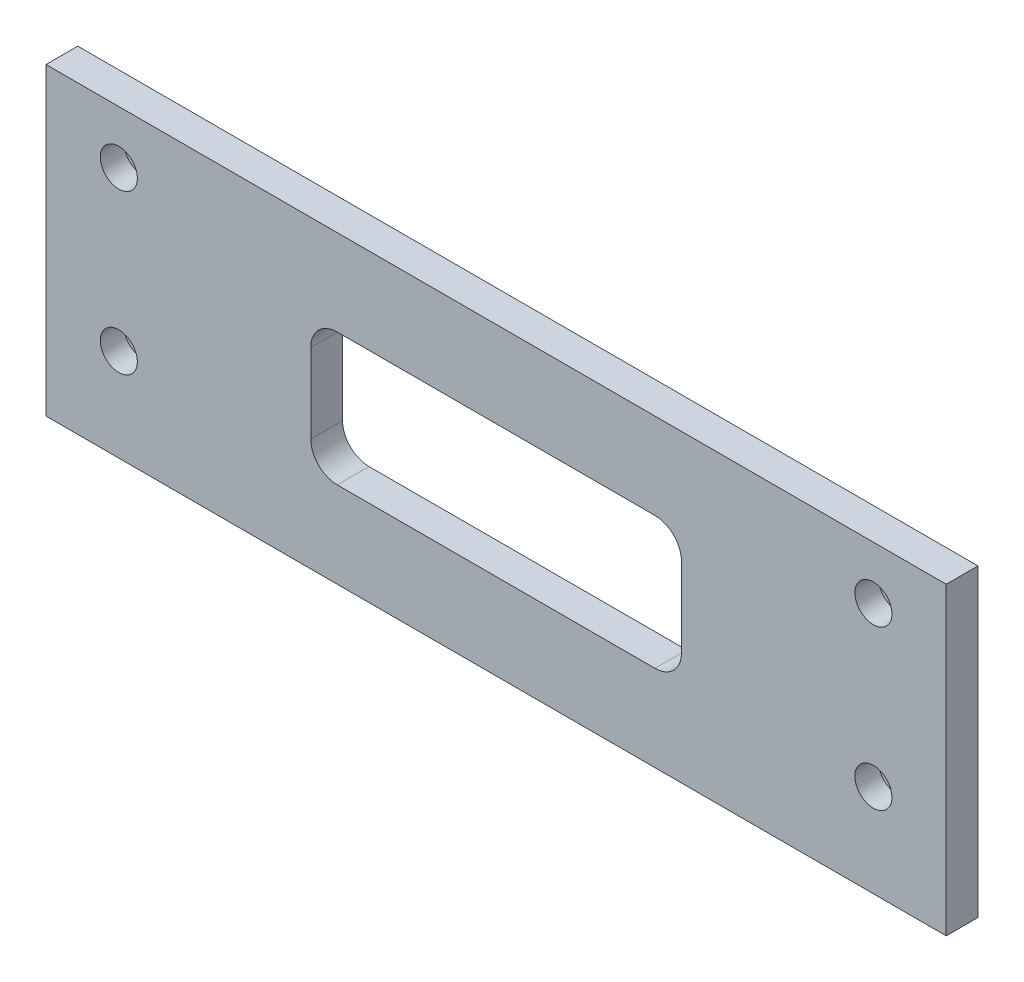
ISO-10303-21;
HEADER;
FILE_DESCRIPTION(('STEP AP214'),'2;1');
FILE_NAME('part.step','',(''),(''),'','','');
FILE_SCHEMA(('AUTOMOTIVE_DESIGN { 1 0 10303 214 1 1 1 1 }'));
ENDSEC;
DATA;
#1=APPLICATION_CONTEXT('core data for automotive mechanical design processes');
#2=APPLICATION_PROTOCOL_DEFINITION('international standard','automotive_design',2000,#1);
#3=PRODUCT_CONTEXT('',#1,'mechanical');
#4=PRODUCT('Part','Part','',(#3));
#5=PRODUCT_RELATED_PRODUCT_CATEGORY('part','',(#4));
#6=PRODUCT_DEFINITION_FORMATION('','',#4);
#7=PRODUCT_DEFINITION_CONTEXT('part definition',#1,'design');
#8=PRODUCT_DEFINITION('design','',#6,#7);
#9=PRODUCT_DEFINITION_SHAPE('','',#8);
#10=(LENGTH_UNIT() NAMED_UNIT(*) SI_UNIT(.MILLI.,.METRE.));
#11=(NAMED_UNIT(*) PLANE_ANGLE_UNIT() SI_UNIT($,.RADIAN.));
#12=(NAMED_UNIT(*) SI_UNIT($,.STERADIAN.) SOLID_ANGLE_UNIT());
#13=UNCERTAINTY_MEASURE_WITH_UNIT(LENGTH_MEASURE(1.E-05),#10,'distance_accuracy_value','');
#14=(GEOMETRIC_REPRESENTATION_CONTEXT(3) GLOBAL_UNCERTAINTY_ASSIGNED_CONTEXT((#13)) GLOBAL_UNIT_ASSIGNED_CONTEXT((#10,
#11,#12)) REPRESENTATION_CONTEXT('',''));
#15=CARTESIAN_POINT('',(0.,0.,0.));
#16=DIRECTION('',(0.,0.,1.));
#17=DIRECTION('',(1.,0.,0.));
#18=AXIS2_PLACEMENT_3D('',#15,#16,#17);
#19=CARTESIAN_POINT('',(170.,-57.5,12.));
#20=DIRECTION('',(-1.,0.,0.));
#21=DIRECTION('',(0.,0.,1.));
#22=AXIS2_PLACEMENT_3D('',#19,#20,#21);
#23=PLANE('',#22);
#24=DIRECTION('',(0.,1.,0.));
#25=VECTOR('',#24,1.);
#26=CARTESIAN_POINT('',(170.,-57.5,0.));
#27=LINE('',#26,#25);
#28=CARTESIAN_POINT('',(170.,-57.5,0.));
#29=VERTEX_POINT('',#28);
#30=CARTESIAN_POINT('',(170.,57.5,0.));
#31=VERTEX_POINT('',#30);
#32=EDGE_CURVE('E252',#29,#31,#27,.T.);
#33=ORIENTED_EDGE('',*,*,#32,.T.);
#34=DIRECTION('',(0.,0.,-1.));
#35=VECTOR('',#34,1.);
#36=CARTESIAN_POINT('',(170.,57.5,12.));
#37=LINE('',#36,#35);
#38=CARTESIAN_POINT('',(170.,57.5,12.));
#39=VERTEX_POINT('',#38);
#40=EDGE_CURVE('E13',#39,#31,#37,.T.);
#41=ORIENTED_EDGE('',*,*,#40,.F.);
#42=DIRECTION('',(0.,1.,0.));
#43=VECTOR('',#42,1.);
#44=CARTESIAN_POINT('',(170.,-57.5,12.));
#45=LINE('',#44,#43);
#46=CARTESIAN_POINT('',(170.,-57.5,12.));
#47=VERTEX_POINT('',#46);
#48=EDGE_CURVE('E253',#47,#39,#45,.T.);
#49=ORIENTED_EDGE('',*,*,#48,.F.);
#50=DIRECTION('',(0.,0.,-1.));
#51=VECTOR('',#50,1.);
#52=CARTESIAN_POINT('',(170.,-57.5,12.));
#53=LINE('',#52,#51);
#54=EDGE_CURVE('E263',#47,#29,#53,.T.);
#55=ORIENTED_EDGE('',*,*,#54,.T.);
#56=EDGE_LOOP('',(#33,#41,#49,#55));
#57=FACE_BOUND('',#56,.T.);
#58=ADVANCED_FACE('F48',(#57),#23,.F.);
#59=CARTESIAN_POINT('',(-170.,57.5,12.));
#60=DIRECTION('',(0.,-1.,0.));
#61=DIRECTION('',(0.,0.,-1.));
#62=AXIS2_PLACEMENT_3D('',#59,#60,#61);
#63=PLANE('',#62);
#64=DIRECTION('',(-1.,0.,0.));
#65=VECTOR('',#64,1.);
#66=CARTESIAN_POINT('',(-170.,57.5,0.));
#67=LINE('',#66,#65);
#68=CARTESIAN_POINT('',(-170.,57.5,0.));
#69=VERTEX_POINT('',#68);
#70=EDGE_CURVE('E266',#31,#69,#67,.T.);
#71=ORIENTED_EDGE('',*,*,#70,.T.);
#72=DIRECTION('',(0.,0.,-1.));
#73=VECTOR('',#72,1.);
#74=CARTESIAN_POINT('',(-170.,57.5,12.));
#75=LINE('',#74,#73);
#76=CARTESIAN_POINT('',(-170.,57.5,12.));
#77=VERTEX_POINT('',#76);
#78=EDGE_CURVE('E55',#77,#69,#75,.T.);
#79=ORIENTED_EDGE('',*,*,#78,.F.);
#80=DIRECTION('',(-1.,0.,0.));
#81=VECTOR('',#80,1.);
#82=CARTESIAN_POINT('',(-170.,57.5,12.));
#83=LINE('',#82,#81);
#84=EDGE_CURVE('E256',#39,#77,#83,.T.);
#85=ORIENTED_EDGE('',*,*,#84,.F.);
#86=ORIENTED_EDGE('',*,*,#40,.T.);
#87=EDGE_LOOP('',(#71,#79,#85,#86));
#88=FACE_BOUND('',#87,.T.);
#89=ADVANCED_FACE('F295',(#88),#63,.F.);
#90=CARTESIAN_POINT('',(-170.,-57.5,12.));
#91=DIRECTION('',(1.,0.,0.));
#92=DIRECTION('',(0.,0.,-1.));
#93=AXIS2_PLACEMENT_3D('',#90,#91,#92);
#94=PLANE('',#93);
#95=DIRECTION('',(0.,-1.,0.));
#96=VECTOR('',#95,1.);
#97=CARTESIAN_POINT('',(-170.,-57.5,0.));
#98=LINE('',#97,#96);
#99=CARTESIAN_POINT('',(-170.,-57.5,0.));
#100=VERTEX_POINT('',#99);
#101=EDGE_CURVE('E268',#69,#100,#98,.T.);
#102=ORIENTED_EDGE('',*,*,#101,.T.);
#103=DIRECTION('',(0.,0.,-1.));
#104=VECTOR('',#103,1.);
#105=CARTESIAN_POINT('',(-170.,-57.5,12.));
#106=LINE('',#105,#104);
#107=CARTESIAN_POINT('',(-170.,-57.5,12.));
#108=VERTEX_POINT('',#107);
#109=EDGE_CURVE('E273',#108,#100,#106,.T.);
#110=ORIENTED_EDGE('',*,*,#109,.F.);
#111=DIRECTION('',(0.,-1.,0.));
#112=VECTOR('',#111,1.);
#113=CARTESIAN_POINT('',(-170.,-57.5,12.));
#114=LINE('',#113,#112);
#115=EDGE_CURVE('E259',#77,#108,#114,.T.);
#116=ORIENTED_EDGE('',*,*,#115,.F.);
#117=ORIENTED_EDGE('',*,*,#78,.T.);
#118=EDGE_LOOP('',(#102,#110,#116,#117));
#119=FACE_BOUND('',#118,.T.);
#120=ADVANCED_FACE('F280',(#119),#94,.F.);
#121=CARTESIAN_POINT('',(-170.,-57.5,12.));
#122=DIRECTION('',(0.,1.,0.));
#123=DIRECTION('',(0.,0.,1.));
#124=AXIS2_PLACEMENT_3D('',#121,#122,#123);
#125=PLANE('',#124);
#126=DIRECTION('',(1.,0.,0.));
#127=VECTOR('',#126,1.);
#128=CARTESIAN_POINT('',(-170.,-57.5,0.));
#129=LINE('',#128,#127);
#130=EDGE_CURVE('E257',#100,#29,#129,.T.);
#131=ORIENTED_EDGE('',*,*,#130,.T.);
#132=ORIENTED_EDGE('',*,*,#54,.F.);
#133=DIRECTION('',(1.,0.,0.));
#134=VECTOR('',#133,1.);
#135=CARTESIAN_POINT('',(-170.,-57.5,12.));
#136=LINE('',#135,#134);
#137=EDGE_CURVE('E261',#108,#47,#136,.T.);
#138=ORIENTED_EDGE('',*,*,#137,.F.);
#139=ORIENTED_EDGE('',*,*,#109,.T.);
#140=EDGE_LOOP('',(#131,#132,#138,#139));
#141=FACE_BOUND('',#140,.T.);
#142=ADVANCED_FACE('F288',(#141),#125,.F.);
#143=CARTESIAN_POINT('',(0.,0.,12.));
#144=DIRECTION('',(0.,0.,-1.));
#145=DIRECTION('',(-1.,0.,0.));
#146=AXIS2_PLACEMENT_3D('',#143,#144,#145);
#147=PLANE('',#146);
#148=DIRECTION('',(0.,1.,0.));
#149=VECTOR('',#148,1.);
#150=CARTESIAN_POINT('',(70.,14.9999999999999,12.));
#151=LINE('',#150,#149);
#152=CARTESIAN_POINT('',(70.,-14.9999999999999,12.));
#153=VERTEX_POINT('',#152);
#154=CARTESIAN_POINT('',(70.,14.9999999999999,12.));
#155=VERTEX_POINT('',#154);
#156=EDGE_CURVE('E175',#153,#155,#151,.T.);
#157=ORIENTED_EDGE('',*,*,#156,.F.);
#158=CARTESIAN_POINT('',(60.,-15.,12.));
#159=DIRECTION('',(0.,0.,1.));
#160=DIRECTION('',(1.,0.,0.));
#161=AXIS2_PLACEMENT_3D('',#158,#159,#160);
#162=CIRCLE('',#161,10.);
#163=CARTESIAN_POINT('',(60.,-25.,12.));
#164=VERTEX_POINT('',#163);
#165=EDGE_CURVE('E62',#164,#153,#162,.T.);
#166=ORIENTED_EDGE('',*,*,#165,.F.);
#167=DIRECTION('',(1.,0.,0.));
#168=VECTOR('',#167,1.);
#169=CARTESIAN_POINT('',(-59.9999999999999,-25.,12.));
#170=LINE('',#169,#168);
#171=CARTESIAN_POINT('',(-59.9999999999999,-25.,12.));
#172=VERTEX_POINT('',#171);
#173=EDGE_CURVE('E155',#172,#164,#170,.T.);
#174=ORIENTED_EDGE('',*,*,#173,.F.);
#175=CARTESIAN_POINT('',(-60.,-15.,12.));
#176=DIRECTION('',(0.,0.,1.));
#177=DIRECTION('',(1.,0.,0.));
#178=AXIS2_PLACEMENT_3D('',#175,#176,#177);
#179=CIRCLE('',#178,10.);
#180=CARTESIAN_POINT('',(-70.,-14.9999999999999,12.));
#181=VERTEX_POINT('',#180);
#182=EDGE_CURVE('E158',#181,#172,#179,.T.);
#183=ORIENTED_EDGE('',*,*,#182,.F.);
#184=DIRECTION('',(0.,-1.,0.));
#185=VECTOR('',#184,1.);
#186=CARTESIAN_POINT('',(-70.,14.9999999999999,12.));
#187=LINE('',#186,#185);
#188=CARTESIAN_POINT('',(-70.,14.9999999999999,12.));
#189=VERTEX_POINT('',#188);
#190=EDGE_CURVE('E186',#189,#181,#187,.T.);
#191=ORIENTED_EDGE('',*,*,#190,.F.);
#192=CARTESIAN_POINT('',(-60.,15.,12.));
#193=DIRECTION('',(0.,0.,1.));
#194=DIRECTION('',(1.,0.,0.));
#195=AXIS2_PLACEMENT_3D('',#192,#193,#194);
#196=CIRCLE('',#195,10.);
#197=CARTESIAN_POINT('',(-59.9999999999999,25.,12.));
#198=VERTEX_POINT('',#197);
#199=EDGE_CURVE('E183',#198,#189,#196,.T.);
#200=ORIENTED_EDGE('',*,*,#199,.F.);
#201=DIRECTION('',(-1.,0.,0.));
#202=VECTOR('',#201,1.);
#203=CARTESIAN_POINT('',(-59.9999999999999,25.,12.));
#204=LINE('',#203,#202);
#205=CARTESIAN_POINT('',(60.,25.,12.));
#206=VERTEX_POINT('',#205);
#207=EDGE_CURVE('E180',#206,#198,#204,.T.);
#208=ORIENTED_EDGE('',*,*,#207,.F.);
#209=CARTESIAN_POINT('',(60.,15.,12.));
#210=DIRECTION('',(0.,0.,1.));
#211=DIRECTION('',(-1.,0.,0.));
#212=AXIS2_PLACEMENT_3D('',#209,#210,#211);
#213=CIRCLE('',#212,10.);
#214=EDGE_CURVE('E177',#155,#206,#213,.T.);
#215=ORIENTED_EDGE('',*,*,#214,.F.);
#216=EDGE_LOOP('',(#157,#166,#174,#183,#191,#200,#208,#215));
#217=FACE_BOUND('',#216,.T.);
#218=CARTESIAN_POINT('',(-142.5,37.5,12.));
#219=DIRECTION('',(0.,0.,1.));
#220=DIRECTION('',(1.,0.,0.));
#221=AXIS2_PLACEMENT_3D('',#218,#219,#220);
#222=CIRCLE('',#221,7.00000000000001);
#223=CARTESIAN_POINT('',(-135.5,37.5,12.));
#224=VERTEX_POINT('',#223);
#225=EDGE_CURVE('E193',#224,#224,#222,.T.);
#226=ORIENTED_EDGE('',*,*,#225,.F.);
#227=EDGE_LOOP('',(#226));
#228=FACE_BOUND('',#227,.T.);
#229=CARTESIAN_POINT('',(142.5,37.5,12.));
#230=DIRECTION('',(0.,0.,1.));
#231=DIRECTION('',(1.,0.,0.));
#232=AXIS2_PLACEMENT_3D('',#229,#230,#231);
#233=CIRCLE('',#232,7.00000000000001);
#234=CARTESIAN_POINT('',(149.5,37.5,12.));
#235=VERTEX_POINT('',#234);
#236=EDGE_CURVE('E216',#235,#235,#233,.T.);
#237=ORIENTED_EDGE('',*,*,#236,.F.);
#238=EDGE_LOOP('',(#237));
#239=FACE_BOUND('',#238,.T.);
#240=CARTESIAN_POINT('',(142.5,-22.5,12.));
#241=DIRECTION('',(0.,0.,1.));
#242=DIRECTION('',(1.,0.,0.));
#243=AXIS2_PLACEMENT_3D('',#240,#241,#242);
#244=CIRCLE('',#243,7.00000000000001);
#245=CARTESIAN_POINT('',(149.5,-22.5,12.));
#246=VERTEX_POINT('',#245);
#247=EDGE_CURVE('E228',#246,#246,#244,.T.);
#248=ORIENTED_EDGE('',*,*,#247,.F.);
#249=EDGE_LOOP('',(#248));
#250=FACE_BOUND('',#249,.T.);
#251=CARTESIAN_POINT('',(-142.5,-22.5,12.));
#252=DIRECTION('',(0.,0.,1.));
#253=DIRECTION('',(1.,0.,0.));
#254=AXIS2_PLACEMENT_3D('',#251,#252,#253);
#255=CIRCLE('',#254,7.00000000000001);
#256=CARTESIAN_POINT('',(-135.5,-22.5,12.));
#257=VERTEX_POINT('',#256);
#258=EDGE_CURVE('E240',#257,#257,#255,.T.);
#259=ORIENTED_EDGE('',*,*,#258,.F.);
#260=EDGE_LOOP('',(#259));
#261=FACE_BOUND('',#260,.T.);
#262=ORIENTED_EDGE('',*,*,#48,.T.);
#263=ORIENTED_EDGE('',*,*,#84,.T.);
#264=ORIENTED_EDGE('',*,*,#115,.T.);
#265=ORIENTED_EDGE('',*,*,#137,.T.);
#266=EDGE_LOOP('',(#262,#263,#264,#265));
#267=FACE_BOUND('',#266,.T.);
#268=ADVANCED_FACE('F294',(#217,#228,#239,#250,#261,#267),#147,.F.);
#269=CARTESIAN_POINT('',(0.,0.,0.));
#270=DIRECTION('',(0.,0.,-1.));
#271=DIRECTION('',(-1.,0.,0.));
#272=AXIS2_PLACEMENT_3D('',#269,#270,#271);
#273=PLANE('',#272);
#274=CARTESIAN_POINT('',(60.,-15.,0.));
#275=DIRECTION('',(0.,0.,1.));
#276=DIRECTION('',(1.,0.,0.));
#277=AXIS2_PLACEMENT_3D('',#274,#275,#276);
#278=CIRCLE('',#277,10.);
#279=CARTESIAN_POINT('',(60.,-25.,0.));
#280=VERTEX_POINT('',#279);
#281=CARTESIAN_POINT('',(70.,-14.9999999999999,0.));
#282=VERTEX_POINT('',#281);
#283=EDGE_CURVE('E138',#280,#282,#278,.T.);
#284=ORIENTED_EDGE('',*,*,#283,.T.);
#285=DIRECTION('',(0.,1.,0.));
#286=VECTOR('',#285,1.);
#287=CARTESIAN_POINT('',(70.,14.9999999999999,0.));
#288=LINE('',#287,#286);
#289=CARTESIAN_POINT('',(70.,14.9999999999999,0.));
#290=VERTEX_POINT('',#289);
#291=EDGE_CURVE('E147',#282,#290,#288,.T.);
#292=ORIENTED_EDGE('',*,*,#291,.T.);
#293=CARTESIAN_POINT('',(60.,15.,0.));
#294=DIRECTION('',(0.,0.,1.));
#295=DIRECTION('',(-1.,0.,0.));
#296=AXIS2_PLACEMENT_3D('',#293,#294,#295);
#297=CIRCLE('',#296,10.);
#298=CARTESIAN_POINT('',(60.,25.,0.));
#299=VERTEX_POINT('',#298);
#300=EDGE_CURVE('E70',#290,#299,#297,.T.);
#301=ORIENTED_EDGE('',*,*,#300,.T.);
#302=DIRECTION('',(-1.,0.,0.));
#303=VECTOR('',#302,1.);
#304=CARTESIAN_POINT('',(-59.9999999999999,25.,0.));
#305=LINE('',#304,#303);
#306=CARTESIAN_POINT('',(-59.9999999999999,25.,0.));
#307=VERTEX_POINT('',#306);
#308=EDGE_CURVE('E162',#299,#307,#305,.T.);
#309=ORIENTED_EDGE('',*,*,#308,.T.);
#310=CARTESIAN_POINT('',(-60.,15.,0.));
#311=DIRECTION('',(0.,0.,1.));
#312=DIRECTION('',(1.,0.,0.));
#313=AXIS2_PLACEMENT_3D('',#310,#311,#312);
#314=CIRCLE('',#313,10.);
#315=CARTESIAN_POINT('',(-70.,14.9999999999999,0.));
#316=VERTEX_POINT('',#315);
#317=EDGE_CURVE('E165',#307,#316,#314,.T.);
#318=ORIENTED_EDGE('',*,*,#317,.T.);
#319=DIRECTION('',(0.,-1.,0.));
#320=VECTOR('',#319,1.);
#321=CARTESIAN_POINT('',(-70.,14.9999999999999,0.));
#322=LINE('',#321,#320);
#323=CARTESIAN_POINT('',(-70.,-14.9999999999999,0.));
#324=VERTEX_POINT('',#323);
#325=EDGE_CURVE('E168',#316,#324,#322,.T.);
#326=ORIENTED_EDGE('',*,*,#325,.T.);
#327=CARTESIAN_POINT('',(-60.,-15.,0.));
#328=DIRECTION('',(0.,0.,1.));
#329=DIRECTION('',(1.,0.,0.));
#330=AXIS2_PLACEMENT_3D('',#327,#328,#329);
#331=CIRCLE('',#330,10.);
#332=CARTESIAN_POINT('',(-59.9999999999999,-25.,0.));
#333=VERTEX_POINT('',#332);
#334=EDGE_CURVE('E171',#324,#333,#331,.T.);
#335=ORIENTED_EDGE('',*,*,#334,.T.);
#336=DIRECTION('',(1.,0.,0.));
#337=VECTOR('',#336,1.);
#338=CARTESIAN_POINT('',(-59.9999999999999,-25.,0.));
#339=LINE('',#338,#337);
#340=EDGE_CURVE('E144',#333,#280,#339,.T.);
#341=ORIENTED_EDGE('',*,*,#340,.T.);
#342=EDGE_LOOP('',(#284,#292,#301,#309,#318,#326,#335,#341));
#343=FACE_BOUND('',#342,.T.);
#344=CARTESIAN_POINT('',(-142.5,37.5,0.));
#345=DIRECTION('',(0.,0.,1.));
#346=DIRECTION('',(1.,0.,0.));
#347=AXIS2_PLACEMENT_3D('',#344,#345,#346);
#348=CIRCLE('',#347,4.5);
#349=CARTESIAN_POINT('',(-138.,37.5,0.));
#350=VERTEX_POINT('',#349);
#351=EDGE_CURVE('E213',#350,#350,#348,.T.);
#352=ORIENTED_EDGE('',*,*,#351,.T.);
#353=EDGE_LOOP('',(#352));
#354=FACE_BOUND('',#353,.T.);
#355=CARTESIAN_POINT('',(142.5,37.5,0.));
#356=DIRECTION('',(0.,0.,1.));
#357=DIRECTION('',(1.,0.,0.));
#358=AXIS2_PLACEMENT_3D('',#355,#356,#357);
#359=CIRCLE('',#358,4.5);
#360=CARTESIAN_POINT('',(147.,37.5,0.));
#361=VERTEX_POINT('',#360);
#362=EDGE_CURVE('E225',#361,#361,#359,.T.);
#363=ORIENTED_EDGE('',*,*,#362,.T.);
#364=EDGE_LOOP('',(#363));
#365=FACE_BOUND('',#364,.T.);
#366=CARTESIAN_POINT('',(142.5,-22.5,0.));
#367=DIRECTION('',(0.,0.,1.));
#368=DIRECTION('',(1.,0.,0.));
#369=AXIS2_PLACEMENT_3D('',#366,#367,#368);
#370=CIRCLE('',#369,4.5);
#371=CARTESIAN_POINT('',(147.,-22.5,0.));
#372=VERTEX_POINT('',#371);
#373=EDGE_CURVE('E237',#372,#372,#370,.T.);
#374=ORIENTED_EDGE('',*,*,#373,.T.);
#375=EDGE_LOOP('',(#374));
#376=FACE_BOUND('',#375,.T.);
#377=CARTESIAN_POINT('',(-142.5,-22.5,0.));
#378=DIRECTION('',(0.,0.,1.));
#379=DIRECTION('',(1.,0.,0.));
#380=AXIS2_PLACEMENT_3D('',#377,#378,#379);
#381=CIRCLE('',#380,4.5);
#382=CARTESIAN_POINT('',(-138.,-22.5,0.));
#383=VERTEX_POINT('',#382);
#384=EDGE_CURVE('E249',#383,#383,#381,.T.);
#385=ORIENTED_EDGE('',*,*,#384,.T.);
#386=EDGE_LOOP('',(#385));
#387=FACE_BOUND('',#386,.T.);
#388=ORIENTED_EDGE('',*,*,#32,.F.);
#389=ORIENTED_EDGE('',*,*,#130,.F.);
#390=ORIENTED_EDGE('',*,*,#101,.F.);
#391=ORIENTED_EDGE('',*,*,#70,.F.);
#392=EDGE_LOOP('',(#388,#389,#390,#391));
#393=FACE_BOUND('',#392,.T.);
#394=ADVANCED_FACE('F151',(#343,#354,#365,#376,#387,#393),#273,.T.);
#395=CARTESIAN_POINT('',(-142.5,-22.5,12.));
#396=DIRECTION('',(0.,0.,1.));
#397=DIRECTION('',(1.,0.,0.));
#398=AXIS2_PLACEMENT_3D('',#395,#396,#397);
#399=CYLINDRICAL_SURFACE('',#398,4.5);
#400=ORIENTED_EDGE('',*,*,#384,.F.);
#401=EDGE_LOOP('',(#400));
#402=FACE_BOUND('',#401,.T.);
#403=CARTESIAN_POINT('',(-142.5,-22.5,3.));
#404=DIRECTION('',(0.,0.,1.));
#405=DIRECTION('',(1.,0.,0.));
#406=AXIS2_PLACEMENT_3D('',#403,#404,#405);
#407=CIRCLE('',#406,4.5);
#408=CARTESIAN_POINT('',(-138.,-22.5,3.));
#409=VERTEX_POINT('',#408);
#410=EDGE_CURVE('E246',#409,#409,#407,.T.);
#411=ORIENTED_EDGE('',*,*,#410,.T.);
#412=EDGE_LOOP('',(#411));
#413=FACE_BOUND('',#412,.T.);
#414=ADVANCED_FACE('F307',(#402,#413),#399,.F.);
#415=CARTESIAN_POINT('',(-138.,-22.5,3.));
#416=DIRECTION('',(0.,0.,-1.));
#417=DIRECTION('',(-1.,0.,0.));
#418=AXIS2_PLACEMENT_3D('',#415,#416,#417);
#419=PLANE('',#418);
#420=ORIENTED_EDGE('',*,*,#410,.F.);
#421=EDGE_LOOP('',(#420));
#422=FACE_BOUND('',#421,.T.);
#423=CARTESIAN_POINT('',(-142.5,-22.5,3.));
#424=DIRECTION('',(0.,0.,1.));
#425=DIRECTION('',(1.,0.,0.));
#426=AXIS2_PLACEMENT_3D('',#423,#424,#425);
#427=CIRCLE('',#426,7.00000000000001);
#428=CARTESIAN_POINT('',(-135.5,-22.5,3.));
#429=VERTEX_POINT('',#428);
#430=EDGE_CURVE('E243',#429,#429,#427,.T.);
#431=ORIENTED_EDGE('',*,*,#430,.T.);
#432=EDGE_LOOP('',(#431));
#433=FACE_BOUND('',#432,.T.);
#434=ADVANCED_FACE('F313',(#422,#433),#419,.F.);
#435=CARTESIAN_POINT('',(-142.5,-22.5,12.));
#436=DIRECTION('',(0.,0.,1.));
#437=DIRECTION('',(1.,0.,0.));
#438=AXIS2_PLACEMENT_3D('',#435,#436,#437);
#439=CYLINDRICAL_SURFACE('',#438,7.00000000000001);
#440=ORIENTED_EDGE('',*,*,#430,.F.);
#441=EDGE_LOOP('',(#440));
#442=FACE_BOUND('',#441,.T.);
#443=ORIENTED_EDGE('',*,*,#258,.T.);
#444=EDGE_LOOP('',(#443));
#445=FACE_BOUND('',#444,.T.);
#446=ADVANCED_FACE('F317',(#442,#445),#439,.F.);
#447=CARTESIAN_POINT('',(142.5,-22.5,12.));
#448=DIRECTION('',(0.,0.,1.));
#449=DIRECTION('',(1.,0.,0.));
#450=AXIS2_PLACEMENT_3D('',#447,#448,#449);
#451=CYLINDRICAL_SURFACE('',#450,4.5);
#452=ORIENTED_EDGE('',*,*,#373,.F.);
#453=EDGE_LOOP('',(#452));
#454=FACE_BOUND('',#453,.T.);
#455=CARTESIAN_POINT('',(142.5,-22.5,3.));
#456=DIRECTION('',(0.,0.,1.));
#457=DIRECTION('',(1.,0.,0.));
#458=AXIS2_PLACEMENT_3D('',#455,#456,#457);
#459=CIRCLE('',#458,4.5);
#460=CARTESIAN_POINT('',(147.,-22.5,3.));
#461=VERTEX_POINT('',#460);
#462=EDGE_CURVE('E234',#461,#461,#459,.T.);
#463=ORIENTED_EDGE('',*,*,#462,.T.);
#464=EDGE_LOOP('',(#463));
#465=FACE_BOUND('',#464,.T.);
#466=ADVANCED_FACE('F321',(#454,#465),#451,.F.);
#467=CARTESIAN_POINT('',(147.,-22.5,3.));
#468=DIRECTION('',(0.,0.,-1.));
#469=DIRECTION('',(-1.,0.,0.));
#470=AXIS2_PLACEMENT_3D('',#467,#468,#469);
#471=PLANE('',#470);
#472=ORIENTED_EDGE('',*,*,#462,.F.);
#473=EDGE_LOOP('',(#472));
#474=FACE_BOUND('',#473,.T.);
#475=CARTESIAN_POINT('',(142.5,-22.5,3.));
#476=DIRECTION('',(0.,0.,1.));
#477=DIRECTION('',(1.,0.,0.));
#478=AXIS2_PLACEMENT_3D('',#475,#476,#477);
#479=CIRCLE('',#478,7.00000000000001);
#480=CARTESIAN_POINT('',(149.5,-22.5,3.));
#481=VERTEX_POINT('',#480);
#482=EDGE_CURVE('E231',#481,#481,#479,.T.);
#483=ORIENTED_EDGE('',*,*,#482,.T.);
#484=EDGE_LOOP('',(#483));
#485=FACE_BOUND('',#484,.T.);
#486=ADVANCED_FACE('F325',(#474,#485),#471,.F.);
#487=CARTESIAN_POINT('',(142.5,-22.5,12.));
#488=DIRECTION('',(0.,0.,1.));
#489=DIRECTION('',(1.,0.,0.));
#490=AXIS2_PLACEMENT_3D('',#487,#488,#489);
#491=CYLINDRICAL_SURFACE('',#490,7.00000000000001);
#492=ORIENTED_EDGE('',*,*,#482,.F.);
#493=EDGE_LOOP('',(#492));
#494=FACE_BOUND('',#493,.T.);
#495=ORIENTED_EDGE('',*,*,#247,.T.);
#496=EDGE_LOOP('',(#495));
#497=FACE_BOUND('',#496,.T.);
#498=ADVANCED_FACE('F329',(#494,#497),#491,.F.);
#499=CARTESIAN_POINT('',(142.5,37.5,12.));
#500=DIRECTION('',(0.,0.,1.));
#501=DIRECTION('',(1.,0.,0.));
#502=AXIS2_PLACEMENT_3D('',#499,#500,#501);
#503=CYLINDRICAL_SURFACE('',#502,4.5);
#504=ORIENTED_EDGE('',*,*,#362,.F.);
#505=EDGE_LOOP('',(#504));
#506=FACE_BOUND('',#505,.T.);
#507=CARTESIAN_POINT('',(142.5,37.5,3.));
#508=DIRECTION('',(0.,0.,1.));
#509=DIRECTION('',(1.,0.,0.));
#510=AXIS2_PLACEMENT_3D('',#507,#508,#509);
#511=CIRCLE('',#510,4.5);
#512=CARTESIAN_POINT('',(147.,37.5,3.));
#513=VERTEX_POINT('',#512);
#514=EDGE_CURVE('E222',#513,#513,#511,.T.);
#515=ORIENTED_EDGE('',*,*,#514,.T.);
#516=EDGE_LOOP('',(#515));
#517=FACE_BOUND('',#516,.T.);
#518=ADVANCED_FACE('F333',(#506,#517),#503,.F.);
#519=CARTESIAN_POINT('',(147.,37.5,3.));
#520=DIRECTION('',(0.,0.,-1.));
#521=DIRECTION('',(-1.,0.,0.));
#522=AXIS2_PLACEMENT_3D('',#519,#520,#521);
#523=PLANE('',#522);
#524=ORIENTED_EDGE('',*,*,#514,.F.);
#525=EDGE_LOOP('',(#524));
#526=FACE_BOUND('',#525,.T.);
#527=CARTESIAN_POINT('',(142.5,37.5,3.));
#528=DIRECTION('',(0.,0.,1.));
#529=DIRECTION('',(1.,0.,0.));
#530=AXIS2_PLACEMENT_3D('',#527,#528,#529);
#531=CIRCLE('',#530,7.00000000000001);
#532=CARTESIAN_POINT('',(149.5,37.5,3.));
#533=VERTEX_POINT('',#532);
#534=EDGE_CURVE('E219',#533,#533,#531,.T.);
#535=ORIENTED_EDGE('',*,*,#534,.T.);
#536=EDGE_LOOP('',(#535));
#537=FACE_BOUND('',#536,.T.);
#538=ADVANCED_FACE('F337',(#526,#537),#523,.F.);
#539=CARTESIAN_POINT('',(142.5,37.5,12.));
#540=DIRECTION('',(0.,0.,1.));
#541=DIRECTION('',(1.,0.,0.));
#542=AXIS2_PLACEMENT_3D('',#539,#540,#541);
#543=CYLINDRICAL_SURFACE('',#542,7.00000000000001);
#544=ORIENTED_EDGE('',*,*,#534,.F.);
#545=EDGE_LOOP('',(#544));
#546=FACE_BOUND('',#545,.T.);
#547=ORIENTED_EDGE('',*,*,#236,.T.);
#548=EDGE_LOOP('',(#547));
#549=FACE_BOUND('',#548,.T.);
#550=ADVANCED_FACE('F341',(#546,#549),#543,.F.);
#551=CARTESIAN_POINT('',(-142.5,37.5,12.));
#552=DIRECTION('',(0.,0.,1.));
#553=DIRECTION('',(1.,0.,0.));
#554=AXIS2_PLACEMENT_3D('',#551,#552,#553);
#555=CYLINDRICAL_SURFACE('',#554,4.5);
#556=ORIENTED_EDGE('',*,*,#351,.F.);
#557=EDGE_LOOP('',(#556));
#558=FACE_BOUND('',#557,.T.);
#559=CARTESIAN_POINT('',(-142.5,37.5,3.));
#560=DIRECTION('',(0.,0.,1.));
#561=DIRECTION('',(1.,0.,0.));
#562=AXIS2_PLACEMENT_3D('',#559,#560,#561);
#563=CIRCLE('',#562,4.5);
#564=CARTESIAN_POINT('',(-138.,37.5,3.));
#565=VERTEX_POINT('',#564);
#566=EDGE_CURVE('E210',#565,#565,#563,.T.);
#567=ORIENTED_EDGE('',*,*,#566,.T.);
#568=EDGE_LOOP('',(#567));
#569=FACE_BOUND('',#568,.T.);
#570=ADVANCED_FACE('F345',(#558,#569),#555,.F.);
#571=CARTESIAN_POINT('',(-138.,37.5,3.));
#572=DIRECTION('',(0.,0.,-1.));
#573=DIRECTION('',(-1.,0.,0.));
#574=AXIS2_PLACEMENT_3D('',#571,#572,#573);
#575=PLANE('',#574);
#576=ORIENTED_EDGE('',*,*,#566,.F.);
#577=EDGE_LOOP('',(#576));
#578=FACE_BOUND('',#577,.T.);
#579=CARTESIAN_POINT('',(-142.5,37.5,3.));
#580=DIRECTION('',(0.,0.,1.));
#581=DIRECTION('',(1.,0.,0.));
#582=AXIS2_PLACEMENT_3D('',#579,#580,#581);
#583=CIRCLE('',#582,7.00000000000001);
#584=CARTESIAN_POINT('',(-135.5,37.5,3.));
#585=VERTEX_POINT('',#584);
#586=EDGE_CURVE('E207',#585,#585,#583,.T.);
#587=ORIENTED_EDGE('',*,*,#586,.T.);
#588=EDGE_LOOP('',(#587));
#589=FACE_BOUND('',#588,.T.);
#590=ADVANCED_FACE('F349',(#578,#589),#575,.F.);
#591=CARTESIAN_POINT('',(-142.5,37.5,12.));
#592=DIRECTION('',(0.,0.,1.));
#593=DIRECTION('',(1.,0.,0.));
#594=AXIS2_PLACEMENT_3D('',#591,#592,#593);
#595=CYLINDRICAL_SURFACE('',#594,7.00000000000001);
#596=ORIENTED_EDGE('',*,*,#586,.F.);
#597=EDGE_LOOP('',(#596));
#598=FACE_BOUND('',#597,.T.);
#599=ORIENTED_EDGE('',*,*,#225,.T.);
#600=EDGE_LOOP('',(#599));
#601=FACE_BOUND('',#600,.T.);
#602=ADVANCED_FACE('F353',(#598,#601),#595,.F.);
#603=CARTESIAN_POINT('',(60.,-15.,0.));
#604=DIRECTION('',(0.,0.,1.));
#605=DIRECTION('',(1.,0.,0.));
#606=AXIS2_PLACEMENT_3D('',#603,#604,#605);
#607=CYLINDRICAL_SURFACE('',#606,10.);
#608=ORIENTED_EDGE('',*,*,#165,.T.);
#609=DIRECTION('',(0.,0.,1.));
#610=VECTOR('',#609,1.);
#611=CARTESIAN_POINT('',(70.,-14.9999999999999,0.));
#612=LINE('',#611,#610);
#613=EDGE_CURVE('E134',#282,#153,#612,.T.);
#614=ORIENTED_EDGE('',*,*,#613,.F.);
#615=ORIENTED_EDGE('',*,*,#283,.F.);
#616=DIRECTION('',(0.,0.,1.));
#617=VECTOR('',#616,1.);
#618=CARTESIAN_POINT('',(60.,-25.,0.));
#619=LINE('',#618,#617);
#620=EDGE_CURVE('E191',#280,#164,#619,.T.);
#621=ORIENTED_EDGE('',*,*,#620,.T.);
#622=EDGE_LOOP('',(#608,#614,#615,#621));
#623=FACE_BOUND('',#622,.T.);
#624=ADVANCED_FACE('F136',(#623),#607,.F.);
#625=CARTESIAN_POINT('',(-59.9999999999999,-25.,0.));
#626=DIRECTION('',(0.,-1.,0.));
#627=DIRECTION('',(0.,0.,-1.));
#628=AXIS2_PLACEMENT_3D('',#625,#626,#627);
#629=PLANE('',#628);
#630=ORIENTED_EDGE('',*,*,#173,.T.);
#631=ORIENTED_EDGE('',*,*,#620,.F.);
#632=ORIENTED_EDGE('',*,*,#340,.F.);
#633=DIRECTION('',(0.,0.,1.));
#634=VECTOR('',#633,1.);
#635=CARTESIAN_POINT('',(-59.9999999999999,-25.,0.));
#636=LINE('',#635,#634);
#637=EDGE_CURVE('E194',#333,#172,#636,.T.);
#638=ORIENTED_EDGE('',*,*,#637,.T.);
#639=EDGE_LOOP('',(#630,#631,#632,#638));
#640=FACE_BOUND('',#639,.T.);
#641=ADVANCED_FACE('F360',(#640),#629,.F.);
#642=CARTESIAN_POINT('',(-60.,-15.,0.));
#643=DIRECTION('',(0.,0.,1.));
#644=DIRECTION('',(1.,0.,0.));
#645=AXIS2_PLACEMENT_3D('',#642,#643,#644);
#646=CYLINDRICAL_SURFACE('',#645,10.);
#647=ORIENTED_EDGE('',*,*,#182,.T.);
#648=ORIENTED_EDGE('',*,*,#637,.F.);
#649=ORIENTED_EDGE('',*,*,#334,.F.);
#650=DIRECTION('',(0.,0.,1.));
#651=VECTOR('',#650,1.);
#652=CARTESIAN_POINT('',(-70.,-14.9999999999999,0.));
#653=LINE('',#652,#651);
#654=EDGE_CURVE('E196',#324,#181,#653,.T.);
#655=ORIENTED_EDGE('',*,*,#654,.T.);
#656=EDGE_LOOP('',(#647,#648,#649,#655));
#657=FACE_BOUND('',#656,.T.);
#658=ADVANCED_FACE('F377',(#657),#646,.F.);
#659=CARTESIAN_POINT('',(-70.,14.9999999999999,0.));
#660=DIRECTION('',(-1.,0.,0.));
#661=DIRECTION('',(0.,0.,1.));
#662=AXIS2_PLACEMENT_3D('',#659,#660,#661);
#663=PLANE('',#662);
#664=ORIENTED_EDGE('',*,*,#190,.T.);
#665=ORIENTED_EDGE('',*,*,#654,.F.);
#666=ORIENTED_EDGE('',*,*,#325,.F.);
#667=DIRECTION('',(0.,0.,1.));
#668=VECTOR('',#667,1.);
#669=CARTESIAN_POINT('',(-70.,14.9999999999999,0.));
#670=LINE('',#669,#668);
#671=EDGE_CURVE('E198',#316,#189,#670,.T.);
#672=ORIENTED_EDGE('',*,*,#671,.T.);
#673=EDGE_LOOP('',(#664,#665,#666,#672));
#674=FACE_BOUND('',#673,.T.);
#675=ADVANCED_FACE('F373',(#674),#663,.F.);
#676=CARTESIAN_POINT('',(-60.,15.,0.));
#677=DIRECTION('',(0.,0.,1.));
#678=DIRECTION('',(1.,0.,0.));
#679=AXIS2_PLACEMENT_3D('',#676,#677,#678);
#680=CYLINDRICAL_SURFACE('',#679,10.);
#681=ORIENTED_EDGE('',*,*,#199,.T.);
#682=ORIENTED_EDGE('',*,*,#671,.F.);
#683=ORIENTED_EDGE('',*,*,#317,.F.);
#684=DIRECTION('',(0.,0.,1.));
#685=VECTOR('',#684,1.);
#686=CARTESIAN_POINT('',(-59.9999999999999,25.,0.));
#687=LINE('',#686,#685);
#688=EDGE_CURVE('E200',#307,#198,#687,.T.);
#689=ORIENTED_EDGE('',*,*,#688,.T.);
#690=EDGE_LOOP('',(#681,#682,#683,#689));
#691=FACE_BOUND('',#690,.T.);
#692=ADVANCED_FACE('F369',(#691),#680,.F.);
#693=CARTESIAN_POINT('',(-59.9999999999999,25.,0.));
#694=DIRECTION('',(0.,1.,0.));
#695=DIRECTION('',(0.,0.,1.));
#696=AXIS2_PLACEMENT_3D('',#693,#694,#695);
#697=PLANE('',#696);
#698=ORIENTED_EDGE('',*,*,#207,.T.);
#699=ORIENTED_EDGE('',*,*,#688,.F.);
#700=ORIENTED_EDGE('',*,*,#308,.F.);
#701=DIRECTION('',(0.,0.,1.));
#702=VECTOR('',#701,1.);
#703=CARTESIAN_POINT('',(60.,25.,0.));
#704=LINE('',#703,#702);
#705=EDGE_CURVE('E202',#299,#206,#704,.T.);
#706=ORIENTED_EDGE('',*,*,#705,.T.);
#707=EDGE_LOOP('',(#698,#699,#700,#706));
#708=FACE_BOUND('',#707,.T.);
#709=ADVANCED_FACE('F366',(#708),#697,.F.);
#710=CARTESIAN_POINT('',(60.,15.,0.));
#711=DIRECTION('',(0.,0.,1.));
#712=DIRECTION('',(1.,0.,0.));
#713=AXIS2_PLACEMENT_3D('',#710,#711,#712);
#714=CYLINDRICAL_SURFACE('',#713,10.);
#715=ORIENTED_EDGE('',*,*,#214,.T.);
#716=ORIENTED_EDGE('',*,*,#705,.F.);
#717=ORIENTED_EDGE('',*,*,#300,.F.);
#718=DIRECTION('',(0.,0.,1.));
#719=VECTOR('',#718,1.);
#720=CARTESIAN_POINT('',(70.,14.9999999999999,0.));
#721=LINE('',#720,#719);
#722=EDGE_CURVE('E143',#290,#155,#721,.T.);
#723=ORIENTED_EDGE('',*,*,#722,.T.);
#724=EDGE_LOOP('',(#715,#716,#717,#723));
#725=FACE_BOUND('',#724,.T.);
#726=ADVANCED_FACE('F363',(#725),#714,.F.);
#727=CARTESIAN_POINT('',(70.,14.9999999999999,0.));
#728=DIRECTION('',(1.,0.,0.));
#729=DIRECTION('',(0.,1.,0.));
#730=AXIS2_PLACEMENT_3D('',#727,#728,#729);
#731=PLANE('',#730);
#732=ORIENTED_EDGE('',*,*,#156,.T.);
#733=ORIENTED_EDGE('',*,*,#722,.F.);
#734=ORIENTED_EDGE('',*,*,#291,.F.);
#735=ORIENTED_EDGE('',*,*,#613,.T.);
#736=EDGE_LOOP('',(#732,#733,#734,#735));
#737=FACE_BOUND('',#736,.T.);
#738=ADVANCED_FACE('F148',(#737),#731,.F.);
#739=CLOSED_SHELL('',(#58,#89,#120,#142,#268,#394,#414,#434,#446,#466,#486,#498,#518,#538,#550,
#570,#590,#602,#624,#641,#658,#675,#692,#709,#726,#738));
#740=MANIFOLD_SOLID_BREP('B2',#739);
#741=ADVANCED_BREP_SHAPE_REPRESENTATION('',(#18,#740),#14);
#742=SHAPE_DEFINITION_REPRESENTATION(#9,#741);
ENDSEC;
END-ISO-10303-21;
